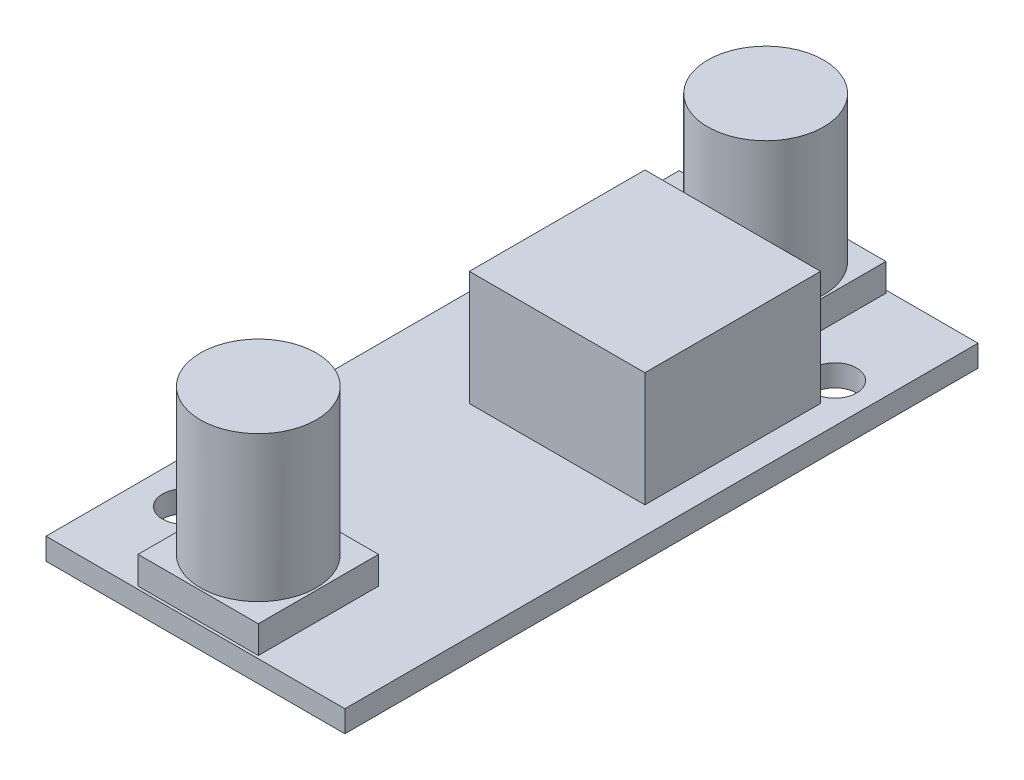
ISO-10303-21;
HEADER;
FILE_DESCRIPTION(('STEP AP214'),'2;1');
FILE_NAME('part.step','',(''),(''),'','','');
FILE_SCHEMA(('AUTOMOTIVE_DESIGN { 1 0 10303 214 1 1 1 1 }'));
ENDSEC;
DATA;
#1=APPLICATION_CONTEXT('core data for automotive mechanical design processes');
#2=APPLICATION_PROTOCOL_DEFINITION('international standard','automotive_design',2000,#1);
#3=PRODUCT_CONTEXT('',#1,'mechanical');
#4=PRODUCT('Part','Part','',(#3));
#5=PRODUCT_RELATED_PRODUCT_CATEGORY('part','',(#4));
#6=PRODUCT_DEFINITION_FORMATION('','',#4);
#7=PRODUCT_DEFINITION_CONTEXT('part definition',#1,'design');
#8=PRODUCT_DEFINITION('design','',#6,#7);
#9=PRODUCT_DEFINITION_SHAPE('','',#8);
#10=(LENGTH_UNIT() NAMED_UNIT(*) SI_UNIT(.MILLI.,.METRE.));
#11=(NAMED_UNIT(*) PLANE_ANGLE_UNIT() SI_UNIT($,.RADIAN.));
#12=(NAMED_UNIT(*) SI_UNIT($,.STERADIAN.) SOLID_ANGLE_UNIT());
#13=UNCERTAINTY_MEASURE_WITH_UNIT(LENGTH_MEASURE(1.E-05),#10,'distance_accuracy_value','');
#14=(GEOMETRIC_REPRESENTATION_CONTEXT(3) GLOBAL_UNCERTAINTY_ASSIGNED_CONTEXT((#13)) GLOBAL_UNIT_ASSIGNED_CONTEXT((#10,
#11,#12)) REPRESENTATION_CONTEXT('',''));
#15=CARTESIAN_POINT('',(0.,0.,0.));
#16=DIRECTION('',(0.,0.,1.));
#17=DIRECTION('',(1.,0.,0.));
#18=AXIS2_PLACEMENT_3D('',#15,#16,#17);
#19=CARTESIAN_POINT('',(0.,1.5,0.));
#20=DIRECTION('',(0.,1.,0.));
#21=DIRECTION('',(0.,0.,1.));
#22=AXIS2_PLACEMENT_3D('',#19,#20,#21);
#23=PLANE('',#22);
#24=DIRECTION('',(1.,0.,0.));
#25=VECTOR('',#24,1.);
#26=CARTESIAN_POINT('',(0.,1.5,-21.66));
#27=LINE('',#26,#25);
#28=CARTESIAN_POINT('',(-4.15,1.5,-21.66));
#29=VERTEX_POINT('',#28);
#30=CARTESIAN_POINT('',(4.15,1.5,-21.66));
#31=VERTEX_POINT('',#30);
#32=EDGE_CURVE('E180',#29,#31,#27,.T.);
#33=ORIENTED_EDGE('',*,*,#32,.T.);
#34=DIRECTION('',(0.,0.,1.));
#35=VECTOR('',#34,1.);
#36=CARTESIAN_POINT('',(4.15,1.5,-13.36));
#37=LINE('',#36,#35);
#38=CARTESIAN_POINT('',(4.15,1.5,-13.36));
#39=VERTEX_POINT('',#38);
#40=EDGE_CURVE('E186',#31,#39,#37,.T.);
#41=ORIENTED_EDGE('',*,*,#40,.T.);
#42=DIRECTION('',(-1.,0.,0.));
#43=VECTOR('',#42,1.);
#44=CARTESIAN_POINT('',(-4.15,1.5,-13.36));
#45=LINE('',#44,#43);
#46=CARTESIAN_POINT('',(-4.15,1.5,-13.36));
#47=VERTEX_POINT('',#46);
#48=EDGE_CURVE('E198',#39,#47,#45,.T.);
#49=ORIENTED_EDGE('',*,*,#48,.T.);
#50=DIRECTION('',(0.,0.,-1.));
#51=VECTOR('',#50,1.);
#52=CARTESIAN_POINT('',(-4.15,1.5,-21.66));
#53=LINE('',#52,#51);
#54=EDGE_CURVE('E56',#47,#29,#53,.T.);
#55=ORIENTED_EDGE('',*,*,#54,.T.);
#56=EDGE_LOOP('',(#33,#41,#49,#55));
#57=FACE_BOUND('',#56,.T.);
#58=CARTESIAN_POINT('',(-7.315,1.5,15.31));
#59=DIRECTION('',(0.,1.,0.));
#60=DIRECTION('',(0.,0.,1.));
#61=AXIS2_PLACEMENT_3D('',#58,#59,#60);
#62=CIRCLE('',#61,1.5);
#63=CARTESIAN_POINT('',(-7.315,1.5,16.81));
#64=VERTEX_POINT('',#63);
#65=EDGE_CURVE('E244',#64,#64,#62,.T.);
#66=ORIENTED_EDGE('',*,*,#65,.F.);
#67=EDGE_LOOP('',(#66));
#68=FACE_BOUND('',#67,.T.);
#69=CARTESIAN_POINT('',(7.605,1.5,-14.68));
#70=DIRECTION('',(0.,1.,0.));
#71=DIRECTION('',(0.,0.,1.));
#72=AXIS2_PLACEMENT_3D('',#69,#70,#71);
#73=CIRCLE('',#72,1.5);
#74=CARTESIAN_POINT('',(7.605,1.5,-13.18));
#75=VERTEX_POINT('',#74);
#76=EDGE_CURVE('E248',#75,#75,#73,.T.);
#77=ORIENTED_EDGE('',*,*,#76,.F.);
#78=EDGE_LOOP('',(#77));
#79=FACE_BOUND('',#78,.T.);
#80=DIRECTION('',(0.,0.,-1.));
#81=VECTOR('',#80,1.);
#82=CARTESIAN_POINT('',(10.315,1.5,-21.85));
#83=LINE('',#82,#81);
#84=CARTESIAN_POINT('',(10.315,1.5,21.85));
#85=VERTEX_POINT('',#84);
#86=CARTESIAN_POINT('',(10.315,1.5,-21.85));
#87=VERTEX_POINT('',#86);
#88=EDGE_CURVE('E257',#85,#87,#83,.T.);
#89=ORIENTED_EDGE('',*,*,#88,.T.);
#90=DIRECTION('',(-1.,0.,0.));
#91=VECTOR('',#90,1.);
#92=CARTESIAN_POINT('',(-10.315,1.5,-21.85));
#93=LINE('',#92,#91);
#94=CARTESIAN_POINT('',(-10.315,1.5,-21.85));
#95=VERTEX_POINT('',#94);
#96=EDGE_CURVE('E260',#87,#95,#93,.T.);
#97=ORIENTED_EDGE('',*,*,#96,.T.);
#98=DIRECTION('',(0.,0.,1.));
#99=VECTOR('',#98,1.);
#100=CARTESIAN_POINT('',(-10.315,1.5,-21.85));
#101=LINE('',#100,#99);
#102=CARTESIAN_POINT('',(-10.315,1.5,21.85));
#103=VERTEX_POINT('',#102);
#104=EDGE_CURVE('E263',#95,#103,#101,.T.);
#105=ORIENTED_EDGE('',*,*,#104,.T.);
#106=DIRECTION('',(1.,0.,0.));
#107=VECTOR('',#106,1.);
#108=CARTESIAN_POINT('',(-10.315,1.5,21.85));
#109=LINE('',#108,#107);
#110=EDGE_CURVE('E265',#103,#85,#109,.T.);
#111=ORIENTED_EDGE('',*,*,#110,.T.);
#112=EDGE_LOOP('',(#89,#97,#105,#111));
#113=FACE_BOUND('',#112,.T.);
#114=DIRECTION('',(-1.,0.,0.));
#115=VECTOR('',#114,1.);
#116=CARTESIAN_POINT('',(-4.15,1.5,13.36));
#117=LINE('',#116,#115);
#118=CARTESIAN_POINT('',(4.15,1.5,13.36));
#119=VERTEX_POINT('',#118);
#120=CARTESIAN_POINT('',(-4.15,1.5,13.36));
#121=VERTEX_POINT('',#120);
#122=EDGE_CURVE('E228',#119,#121,#117,.T.);
#123=ORIENTED_EDGE('',*,*,#122,.F.);
#124=DIRECTION('',(0.,0.,-1.));
#125=VECTOR('',#124,1.);
#126=CARTESIAN_POINT('',(4.15,1.5,13.36));
#127=LINE('',#126,#125);
#128=CARTESIAN_POINT('',(4.15,1.5,21.66));
#129=VERTEX_POINT('',#128);
#130=EDGE_CURVE('E214',#129,#119,#127,.T.);
#131=ORIENTED_EDGE('',*,*,#130,.F.);
#132=DIRECTION('',(1.,0.,0.));
#133=VECTOR('',#132,1.);
#134=CARTESIAN_POINT('',(0.,1.5,21.66));
#135=LINE('',#134,#133);
#136=CARTESIAN_POINT('',(-4.15,1.5,21.66));
#137=VERTEX_POINT('',#136);
#138=EDGE_CURVE('E219',#137,#129,#135,.T.);
#139=ORIENTED_EDGE('',*,*,#138,.F.);
#140=DIRECTION('',(0.,0.,1.));
#141=VECTOR('',#140,1.);
#142=CARTESIAN_POINT('',(-4.15,1.5,21.66));
#143=LINE('',#142,#141);
#144=EDGE_CURVE('E230',#121,#137,#143,.T.);
#145=ORIENTED_EDGE('',*,*,#144,.F.);
#146=EDGE_LOOP('',(#123,#131,#139,#145));
#147=FACE_BOUND('',#146,.T.);
#148=DIRECTION('',(-1.,0.,0.));
#149=VECTOR('',#148,1.);
#150=CARTESIAN_POINT('',(-3.635,1.5,-12.81));
#151=LINE('',#150,#149);
#152=CARTESIAN_POINT('',(8.485,1.5,-12.81));
#153=VERTEX_POINT('',#152);
#154=CARTESIAN_POINT('',(-3.635,1.5,-12.81));
#155=VERTEX_POINT('',#154);
#156=EDGE_CURVE('E311',#153,#155,#151,.T.);
#157=ORIENTED_EDGE('',*,*,#156,.F.);
#158=DIRECTION('',(0.,0.,-1.));
#159=VECTOR('',#158,1.);
#160=CARTESIAN_POINT('',(8.485,1.5,-12.81));
#161=LINE('',#160,#159);
#162=CARTESIAN_POINT('',(8.485,1.5,-0.689999999999993));
#163=VERTEX_POINT('',#162);
#164=EDGE_CURVE('E169',#163,#153,#161,.T.);
#165=ORIENTED_EDGE('',*,*,#164,.F.);
#166=DIRECTION('',(1.,0.,0.));
#167=VECTOR('',#166,1.);
#168=CARTESIAN_POINT('',(-3.63499999999999,1.5,-0.689999999999993));
#169=LINE('',#168,#167);
#170=CARTESIAN_POINT('',(-3.63499999999999,1.5,-0.689999999999993));
#171=VERTEX_POINT('',#170);
#172=EDGE_CURVE('E165',#171,#163,#169,.T.);
#173=ORIENTED_EDGE('',*,*,#172,.F.);
#174=DIRECTION('',(0.,0.,1.));
#175=VECTOR('',#174,1.);
#176=CARTESIAN_POINT('',(-3.635,1.5,-12.81));
#177=LINE('',#176,#175);
#178=EDGE_CURVE('E313',#155,#171,#177,.T.);
#179=ORIENTED_EDGE('',*,*,#178,.F.);
#180=EDGE_LOOP('',(#157,#165,#173,#179));
#181=FACE_BOUND('',#180,.T.);
#182=ADVANCED_FACE('F33',(#57,#68,#79,#113,#147,#181),#23,.T.);
#183=CARTESIAN_POINT('',(10.315,1.5,-21.85));
#184=DIRECTION('',(-1.,0.,0.));
#185=DIRECTION('',(0.,0.,1.));
#186=AXIS2_PLACEMENT_3D('',#183,#184,#185);
#187=PLANE('',#186);
#188=DIRECTION('',(0.,0.,-1.));
#189=VECTOR('',#188,1.);
#190=CARTESIAN_POINT('',(10.315,0.,-21.85));
#191=LINE('',#190,#189);
#192=CARTESIAN_POINT('',(10.315,0.,21.85));
#193=VERTEX_POINT('',#192);
#194=CARTESIAN_POINT('',(10.315,0.,-21.85));
#195=VERTEX_POINT('',#194);
#196=EDGE_CURVE('E254',#193,#195,#191,.T.);
#197=ORIENTED_EDGE('',*,*,#196,.T.);
#198=DIRECTION('',(0.,-1.,0.));
#199=VECTOR('',#198,1.);
#200=CARTESIAN_POINT('',(10.315,1.5,-21.85));
#201=LINE('',#200,#199);
#202=EDGE_CURVE('E41',#87,#195,#201,.T.);
#203=ORIENTED_EDGE('',*,*,#202,.F.);
#204=ORIENTED_EDGE('',*,*,#88,.F.);
#205=DIRECTION('',(0.,-1.,0.));
#206=VECTOR('',#205,1.);
#207=CARTESIAN_POINT('',(10.315,1.5,21.85));
#208=LINE('',#207,#206);
#209=EDGE_CURVE('E267',#85,#193,#208,.T.);
#210=ORIENTED_EDGE('',*,*,#209,.T.);
#211=EDGE_LOOP('',(#197,#203,#204,#210));
#212=FACE_BOUND('',#211,.T.);
#213=ADVANCED_FACE('F35',(#212),#187,.F.);
#214=CARTESIAN_POINT('',(-10.315,1.5,-21.85));
#215=DIRECTION('',(0.,0.,1.));
#216=DIRECTION('',(1.,0.,0.));
#217=AXIS2_PLACEMENT_3D('',#214,#215,#216);
#218=PLANE('',#217);
#219=DIRECTION('',(-1.,0.,0.));
#220=VECTOR('',#219,1.);
#221=CARTESIAN_POINT('',(-10.315,0.,-21.85));
#222=LINE('',#221,#220);
#223=CARTESIAN_POINT('',(-10.315,0.,-21.85));
#224=VERTEX_POINT('',#223);
#225=EDGE_CURVE('E270',#195,#224,#222,.T.);
#226=ORIENTED_EDGE('',*,*,#225,.T.);
#227=DIRECTION('',(0.,-1.,0.));
#228=VECTOR('',#227,1.);
#229=CARTESIAN_POINT('',(-10.315,1.5,-21.85));
#230=LINE('',#229,#228);
#231=EDGE_CURVE('E280',#95,#224,#230,.T.);
#232=ORIENTED_EDGE('',*,*,#231,.F.);
#233=ORIENTED_EDGE('',*,*,#96,.F.);
#234=ORIENTED_EDGE('',*,*,#202,.T.);
#235=EDGE_LOOP('',(#226,#232,#233,#234));
#236=FACE_BOUND('',#235,.T.);
#237=ADVANCED_FACE('F285',(#236),#218,.F.);
#238=CARTESIAN_POINT('',(-10.315,1.5,-21.85));
#239=DIRECTION('',(1.,0.,0.));
#240=DIRECTION('',(0.,0.,-1.));
#241=AXIS2_PLACEMENT_3D('',#238,#239,#240);
#242=PLANE('',#241);
#243=DIRECTION('',(0.,0.,1.));
#244=VECTOR('',#243,1.);
#245=CARTESIAN_POINT('',(-10.315,0.,-21.85));
#246=LINE('',#245,#244);
#247=CARTESIAN_POINT('',(-10.315,0.,21.85));
#248=VERTEX_POINT('',#247);
#249=EDGE_CURVE('E272',#224,#248,#246,.T.);
#250=ORIENTED_EDGE('',*,*,#249,.T.);
#251=DIRECTION('',(0.,-1.,0.));
#252=VECTOR('',#251,1.);
#253=CARTESIAN_POINT('',(-10.315,1.5,21.85));
#254=LINE('',#253,#252);
#255=EDGE_CURVE('E277',#103,#248,#254,.T.);
#256=ORIENTED_EDGE('',*,*,#255,.F.);
#257=ORIENTED_EDGE('',*,*,#104,.F.);
#258=ORIENTED_EDGE('',*,*,#231,.T.);
#259=EDGE_LOOP('',(#250,#256,#257,#258));
#260=FACE_BOUND('',#259,.T.);
#261=ADVANCED_FACE('F297',(#260),#242,.F.);
#262=CARTESIAN_POINT('',(-10.315,1.5,21.85));
#263=DIRECTION('',(0.,0.,-1.));
#264=DIRECTION('',(-1.,0.,0.));
#265=AXIS2_PLACEMENT_3D('',#262,#263,#264);
#266=PLANE('',#265);
#267=DIRECTION('',(1.,0.,0.));
#268=VECTOR('',#267,1.);
#269=CARTESIAN_POINT('',(-10.315,0.,21.85));
#270=LINE('',#269,#268);
#271=EDGE_CURVE('E261',#248,#193,#270,.T.);
#272=ORIENTED_EDGE('',*,*,#271,.T.);
#273=ORIENTED_EDGE('',*,*,#209,.F.);
#274=ORIENTED_EDGE('',*,*,#110,.F.);
#275=ORIENTED_EDGE('',*,*,#255,.T.);
#276=EDGE_LOOP('',(#272,#273,#274,#275));
#277=FACE_BOUND('',#276,.T.);
#278=ADVANCED_FACE('F301',(#277),#266,.F.);
#279=CARTESIAN_POINT('',(0.,0.,0.));
#280=DIRECTION('',(0.,1.,0.));
#281=DIRECTION('',(0.,0.,1.));
#282=AXIS2_PLACEMENT_3D('',#279,#280,#281);
#283=PLANE('',#282);
#284=CARTESIAN_POINT('',(-7.315,0.,15.31));
#285=DIRECTION('',(0.,1.,0.));
#286=DIRECTION('',(0.,0.,1.));
#287=AXIS2_PLACEMENT_3D('',#284,#285,#286);
#288=CIRCLE('',#287,1.5);
#289=CARTESIAN_POINT('',(-7.315,0.,16.81));
#290=VERTEX_POINT('',#289);
#291=EDGE_CURVE('E245',#290,#290,#288,.T.);
#292=ORIENTED_EDGE('',*,*,#291,.T.);
#293=EDGE_LOOP('',(#292));
#294=FACE_BOUND('',#293,.T.);
#295=CARTESIAN_POINT('',(7.605,0.,-14.68));
#296=DIRECTION('',(0.,1.,0.));
#297=DIRECTION('',(0.,0.,1.));
#298=AXIS2_PLACEMENT_3D('',#295,#296,#297);
#299=CIRCLE('',#298,1.5);
#300=CARTESIAN_POINT('',(7.605,0.,-13.18));
#301=VERTEX_POINT('',#300);
#302=EDGE_CURVE('E251',#301,#301,#299,.T.);
#303=ORIENTED_EDGE('',*,*,#302,.T.);
#304=EDGE_LOOP('',(#303));
#305=FACE_BOUND('',#304,.T.);
#306=ORIENTED_EDGE('',*,*,#196,.F.);
#307=ORIENTED_EDGE('',*,*,#271,.F.);
#308=ORIENTED_EDGE('',*,*,#249,.F.);
#309=ORIENTED_EDGE('',*,*,#225,.F.);
#310=EDGE_LOOP('',(#306,#307,#308,#309));
#311=FACE_BOUND('',#310,.T.);
#312=ADVANCED_FACE('F293',(#294,#305,#311),#283,.F.);
#313=CARTESIAN_POINT('',(7.605,0.,-14.68));
#314=DIRECTION('',(0.,1.,0.));
#315=DIRECTION('',(0.,0.,1.));
#316=AXIS2_PLACEMENT_3D('',#313,#314,#315);
#317=CYLINDRICAL_SURFACE('',#316,1.5);
#318=ORIENTED_EDGE('',*,*,#302,.F.);
#319=EDGE_LOOP('',(#318));
#320=FACE_BOUND('',#319,.T.);
#321=ORIENTED_EDGE('',*,*,#76,.T.);
#322=EDGE_LOOP('',(#321));
#323=FACE_BOUND('',#322,.T.);
#324=ADVANCED_FACE('F397',(#320,#323),#317,.F.);
#325=CARTESIAN_POINT('',(-7.315,0.,15.31));
#326=DIRECTION('',(0.,1.,0.));
#327=DIRECTION('',(0.,0.,1.));
#328=AXIS2_PLACEMENT_3D('',#325,#326,#327);
#329=CYLINDRICAL_SURFACE('',#328,1.5);
#330=ORIENTED_EDGE('',*,*,#291,.F.);
#331=EDGE_LOOP('',(#330));
#332=FACE_BOUND('',#331,.T.);
#333=ORIENTED_EDGE('',*,*,#65,.T.);
#334=EDGE_LOOP('',(#333));
#335=FACE_BOUND('',#334,.T.);
#336=ADVANCED_FACE('F393',(#332,#335),#329,.F.);
#337=CARTESIAN_POINT('',(4.15,3.4,13.36));
#338=DIRECTION('',(-1.,0.,0.));
#339=DIRECTION('',(0.,0.,1.));
#340=AXIS2_PLACEMENT_3D('',#337,#338,#339);
#341=PLANE('',#340);
#342=ORIENTED_EDGE('',*,*,#130,.T.);
#343=DIRECTION('',(0.,-1.,0.));
#344=VECTOR('',#343,1.);
#345=CARTESIAN_POINT('',(4.15,3.4,13.36));
#346=LINE('',#345,#344);
#347=CARTESIAN_POINT('',(4.15,3.4,13.36));
#348=VERTEX_POINT('',#347);
#349=EDGE_CURVE('E238',#348,#119,#346,.T.);
#350=ORIENTED_EDGE('',*,*,#349,.F.);
#351=DIRECTION('',(0.,0.,-1.));
#352=VECTOR('',#351,1.);
#353=CARTESIAN_POINT('',(4.15,3.4,13.36));
#354=LINE('',#353,#352);
#355=CARTESIAN_POINT('',(4.15,3.4,21.66));
#356=VERTEX_POINT('',#355);
#357=EDGE_CURVE('E218',#356,#348,#354,.T.);
#358=ORIENTED_EDGE('',*,*,#357,.F.);
#359=DIRECTION('',(0.,-1.,0.));
#360=VECTOR('',#359,1.);
#361=CARTESIAN_POINT('',(4.15,3.4,21.66));
#362=LINE('',#361,#360);
#363=EDGE_CURVE('E241',#356,#129,#362,.T.);
#364=ORIENTED_EDGE('',*,*,#363,.T.);
#365=EDGE_LOOP('',(#342,#350,#358,#364));
#366=FACE_BOUND('',#365,.T.);
#367=ADVANCED_FACE('F389',(#366),#341,.F.);
#368=CARTESIAN_POINT('',(-4.15,3.4,13.36));
#369=DIRECTION('',(0.,0.,1.));
#370=DIRECTION('',(1.,0.,0.));
#371=AXIS2_PLACEMENT_3D('',#368,#369,#370);
#372=PLANE('',#371);
#373=ORIENTED_EDGE('',*,*,#122,.T.);
#374=DIRECTION('',(0.,-1.,0.));
#375=VECTOR('',#374,1.);
#376=CARTESIAN_POINT('',(-4.15,3.4,13.36));
#377=LINE('',#376,#375);
#378=CARTESIAN_POINT('',(-4.15,3.4,13.36));
#379=VERTEX_POINT('',#378);
#380=EDGE_CURVE('E235',#379,#121,#377,.T.);
#381=ORIENTED_EDGE('',*,*,#380,.F.);
#382=DIRECTION('',(-1.,0.,0.));
#383=VECTOR('',#382,1.);
#384=CARTESIAN_POINT('',(-4.15,3.4,13.36));
#385=LINE('',#384,#383);
#386=EDGE_CURVE('E221',#348,#379,#385,.T.);
#387=ORIENTED_EDGE('',*,*,#386,.F.);
#388=ORIENTED_EDGE('',*,*,#349,.T.);
#389=EDGE_LOOP('',(#373,#381,#387,#388));
#390=FACE_BOUND('',#389,.T.);
#391=ADVANCED_FACE('F385',(#390),#372,.F.);
#392=CARTESIAN_POINT('',(-4.15,3.4,21.66));
#393=DIRECTION('',(1.,0.,0.));
#394=DIRECTION('',(0.,0.,-1.));
#395=AXIS2_PLACEMENT_3D('',#392,#393,#394);
#396=PLANE('',#395);
#397=ORIENTED_EDGE('',*,*,#144,.T.);
#398=DIRECTION('',(0.,-1.,0.));
#399=VECTOR('',#398,1.);
#400=CARTESIAN_POINT('',(-4.15,3.4,21.66));
#401=LINE('',#400,#399);
#402=CARTESIAN_POINT('',(-4.15,3.4,21.66));
#403=VERTEX_POINT('',#402);
#404=EDGE_CURVE('E226',#403,#137,#401,.T.);
#405=ORIENTED_EDGE('',*,*,#404,.F.);
#406=DIRECTION('',(0.,0.,1.));
#407=VECTOR('',#406,1.);
#408=CARTESIAN_POINT('',(-4.15,3.4,21.66));
#409=LINE('',#408,#407);
#410=EDGE_CURVE('E223',#379,#403,#409,.T.);
#411=ORIENTED_EDGE('',*,*,#410,.F.);
#412=ORIENTED_EDGE('',*,*,#380,.T.);
#413=EDGE_LOOP('',(#397,#405,#411,#412));
#414=FACE_BOUND('',#413,.T.);
#415=ADVANCED_FACE('F381',(#414),#396,.F.);
#416=CARTESIAN_POINT('',(0.,3.4,21.66));
#417=DIRECTION('',(0.,0.,-1.));
#418=DIRECTION('',(-1.,0.,0.));
#419=AXIS2_PLACEMENT_3D('',#416,#417,#418);
#420=PLANE('',#419);
#421=ORIENTED_EDGE('',*,*,#138,.T.);
#422=ORIENTED_EDGE('',*,*,#363,.F.);
#423=DIRECTION('',(1.,0.,0.));
#424=VECTOR('',#423,1.);
#425=CARTESIAN_POINT('',(4.15,3.4,21.66));
#426=LINE('',#425,#424);
#427=EDGE_CURVE('E215',#403,#356,#426,.T.);
#428=ORIENTED_EDGE('',*,*,#427,.F.);
#429=ORIENTED_EDGE('',*,*,#404,.T.);
#430=EDGE_LOOP('',(#421,#422,#428,#429));
#431=FACE_BOUND('',#430,.T.);
#432=ADVANCED_FACE('F377',(#431),#420,.F.);
#433=CARTESIAN_POINT('',(0.,3.4,0.));
#434=DIRECTION('',(0.,-1.,0.));
#435=DIRECTION('',(0.,0.,-1.));
#436=AXIS2_PLACEMENT_3D('',#433,#434,#435);
#437=PLANE('',#436);
#438=CARTESIAN_POINT('',(0.,3.4,17.51));
#439=DIRECTION('',(0.,-1.,0.));
#440=DIRECTION('',(0.,0.,-1.));
#441=AXIS2_PLACEMENT_3D('',#438,#439,#440);
#442=CIRCLE('',#441,4.);
#443=CARTESIAN_POINT('',(0.,3.4,13.51));
#444=VERTEX_POINT('',#443);
#445=EDGE_CURVE('E11',#444,#444,#442,.F.);
#446=ORIENTED_EDGE('',*,*,#445,.F.);
#447=EDGE_LOOP('',(#446));
#448=FACE_BOUND('',#447,.T.);
#449=ORIENTED_EDGE('',*,*,#427,.T.);
#450=ORIENTED_EDGE('',*,*,#357,.T.);
#451=ORIENTED_EDGE('',*,*,#386,.T.);
#452=ORIENTED_EDGE('',*,*,#410,.T.);
#453=EDGE_LOOP('',(#449,#450,#451,#452));
#454=FACE_BOUND('',#453,.T.);
#455=ADVANCED_FACE('F373',(#448,#454),#437,.F.);
#456=CARTESIAN_POINT('',(0.,13.44,17.51));
#457=DIRECTION('',(0.,-1.,0.));
#458=DIRECTION('',(0.,0.,-1.));
#459=AXIS2_PLACEMENT_3D('',#456,#457,#458);
#460=CYLINDRICAL_SURFACE('',#459,4.);
#461=CARTESIAN_POINT('',(0.,13.44,17.51));
#462=DIRECTION('',(0.,1.,0.));
#463=DIRECTION('',(0.,0.,1.));
#464=AXIS2_PLACEMENT_3D('',#461,#462,#463);
#465=CIRCLE('',#464,4.);
#466=CARTESIAN_POINT('',(0.,13.44,21.51));
#467=VERTEX_POINT('',#466);
#468=EDGE_CURVE('E211',#467,#467,#465,.T.);
#469=ORIENTED_EDGE('',*,*,#468,.F.);
#470=EDGE_LOOP('',(#469));
#471=FACE_BOUND('',#470,.T.);
#472=ORIENTED_EDGE('',*,*,#445,.T.);
#473=EDGE_LOOP('',(#472));
#474=FACE_BOUND('',#473,.T.);
#475=ADVANCED_FACE('F369',(#471,#474),#460,.T.);
#476=CARTESIAN_POINT('',(0.,13.44,17.51));
#477=DIRECTION('',(0.,1.,0.));
#478=DIRECTION('',(0.,0.,1.));
#479=AXIS2_PLACEMENT_3D('',#476,#477,#478);
#480=PLANE('',#479);
#481=ORIENTED_EDGE('',*,*,#468,.T.);
#482=EDGE_LOOP('',(#481));
#483=FACE_BOUND('',#482,.T.);
#484=ADVANCED_FACE('F365',(#483),#480,.T.);
#485=CARTESIAN_POINT('',(0.,3.4,-21.66));
#486=DIRECTION('',(0.,0.,-1.));
#487=DIRECTION('',(-1.,0.,0.));
#488=AXIS2_PLACEMENT_3D('',#485,#486,#487);
#489=PLANE('',#488);
#490=ORIENTED_EDGE('',*,*,#32,.F.);
#491=DIRECTION('',(0.,-1.,0.));
#492=VECTOR('',#491,1.);
#493=CARTESIAN_POINT('',(-4.15,3.4,-21.66));
#494=LINE('',#493,#492);
#495=CARTESIAN_POINT('',(-4.15,3.4,-21.66));
#496=VERTEX_POINT('',#495);
#497=EDGE_CURVE('E209',#496,#29,#494,.T.);
#498=ORIENTED_EDGE('',*,*,#497,.F.);
#499=DIRECTION('',(1.,0.,0.));
#500=VECTOR('',#499,1.);
#501=CARTESIAN_POINT('',(4.15,3.4,-21.66));
#502=LINE('',#501,#500);
#503=CARTESIAN_POINT('',(4.15,3.4,-21.66));
#504=VERTEX_POINT('',#503);
#505=EDGE_CURVE('E182',#496,#504,#502,.T.);
#506=ORIENTED_EDGE('',*,*,#505,.T.);
#507=DIRECTION('',(0.,-1.,0.));
#508=VECTOR('',#507,1.);
#509=CARTESIAN_POINT('',(4.15,3.4,-21.66));
#510=LINE('',#509,#508);
#511=EDGE_CURVE('E195',#504,#31,#510,.T.);
#512=ORIENTED_EDGE('',*,*,#511,.T.);
#513=EDGE_LOOP('',(#490,#498,#506,#512));
#514=FACE_BOUND('',#513,.T.);
#515=ADVANCED_FACE('F361',(#514),#489,.T.);
#516=CARTESIAN_POINT('',(-4.15,3.4,-21.66));
#517=DIRECTION('',(-1.,0.,0.));
#518=DIRECTION('',(0.,0.,1.));
#519=AXIS2_PLACEMENT_3D('',#516,#517,#518);
#520=PLANE('',#519);
#521=ORIENTED_EDGE('',*,*,#54,.F.);
#522=DIRECTION('',(0.,-1.,0.));
#523=VECTOR('',#522,1.);
#524=CARTESIAN_POINT('',(-4.15,3.4,-13.36));
#525=LINE('',#524,#523);
#526=CARTESIAN_POINT('',(-4.15,3.4,-13.36));
#527=VERTEX_POINT('',#526);
#528=EDGE_CURVE('E206',#527,#47,#525,.T.);
#529=ORIENTED_EDGE('',*,*,#528,.F.);
#530=DIRECTION('',(0.,0.,-1.));
#531=VECTOR('',#530,1.);
#532=CARTESIAN_POINT('',(-4.15,3.4,-21.66));
#533=LINE('',#532,#531);
#534=EDGE_CURVE('E185',#527,#496,#533,.T.);
#535=ORIENTED_EDGE('',*,*,#534,.T.);
#536=ORIENTED_EDGE('',*,*,#497,.T.);
#537=EDGE_LOOP('',(#521,#529,#535,#536));
#538=FACE_BOUND('',#537,.T.);
#539=ADVANCED_FACE('F357',(#538),#520,.T.);
#540=CARTESIAN_POINT('',(-4.15,3.4,-13.36));
#541=DIRECTION('',(0.,0.,1.));
#542=DIRECTION('',(1.,0.,0.));
#543=AXIS2_PLACEMENT_3D('',#540,#541,#542);
#544=PLANE('',#543);
#545=ORIENTED_EDGE('',*,*,#48,.F.);
#546=DIRECTION('',(0.,-1.,0.));
#547=VECTOR('',#546,1.);
#548=CARTESIAN_POINT('',(4.15,3.4,-13.36));
#549=LINE('',#548,#547);
#550=CARTESIAN_POINT('',(4.15,3.4,-13.36));
#551=VERTEX_POINT('',#550);
#552=EDGE_CURVE('E203',#551,#39,#549,.T.);
#553=ORIENTED_EDGE('',*,*,#552,.F.);
#554=DIRECTION('',(-1.,0.,0.));
#555=VECTOR('',#554,1.);
#556=CARTESIAN_POINT('',(-4.15,3.4,-13.36));
#557=LINE('',#556,#555);
#558=EDGE_CURVE('E189',#551,#527,#557,.T.);
#559=ORIENTED_EDGE('',*,*,#558,.T.);
#560=ORIENTED_EDGE('',*,*,#528,.T.);
#561=EDGE_LOOP('',(#545,#553,#559,#560));
#562=FACE_BOUND('',#561,.T.);
#563=ADVANCED_FACE('F353',(#562),#544,.T.);
#564=CARTESIAN_POINT('',(4.15,3.4,-13.36));
#565=DIRECTION('',(1.,0.,0.));
#566=DIRECTION('',(0.,0.,-1.));
#567=AXIS2_PLACEMENT_3D('',#564,#565,#566);
#568=PLANE('',#567);
#569=ORIENTED_EDGE('',*,*,#40,.F.);
#570=ORIENTED_EDGE('',*,*,#511,.F.);
#571=DIRECTION('',(0.,0.,1.));
#572=VECTOR('',#571,1.);
#573=CARTESIAN_POINT('',(4.15,3.4,-13.36));
#574=LINE('',#573,#572);
#575=EDGE_CURVE('E192',#504,#551,#574,.T.);
#576=ORIENTED_EDGE('',*,*,#575,.T.);
#577=ORIENTED_EDGE('',*,*,#552,.T.);
#578=EDGE_LOOP('',(#569,#570,#576,#577));
#579=FACE_BOUND('',#578,.T.);
#580=ADVANCED_FACE('F349',(#579),#568,.T.);
#581=CARTESIAN_POINT('',(0.,3.4,0.));
#582=DIRECTION('',(0.,-1.,0.));
#583=DIRECTION('',(0.,0.,1.));
#584=AXIS2_PLACEMENT_3D('',#581,#582,#583);
#585=PLANE('',#584);
#586=CARTESIAN_POINT('',(0.,3.4,-17.51));
#587=DIRECTION('',(0.,-1.,0.));
#588=DIRECTION('',(0.,0.,-1.));
#589=AXIS2_PLACEMENT_3D('',#586,#587,#588);
#590=CIRCLE('',#589,4.);
#591=CARTESIAN_POINT('',(0.,3.4,-21.51));
#592=VERTEX_POINT('',#591);
#593=EDGE_CURVE('E171',#592,#592,#590,.T.);
#594=ORIENTED_EDGE('',*,*,#593,.T.);
#595=EDGE_LOOP('',(#594));
#596=FACE_BOUND('',#595,.T.);
#597=ORIENTED_EDGE('',*,*,#505,.F.);
#598=ORIENTED_EDGE('',*,*,#534,.F.);
#599=ORIENTED_EDGE('',*,*,#558,.F.);
#600=ORIENTED_EDGE('',*,*,#575,.F.);
#601=EDGE_LOOP('',(#597,#598,#599,#600));
#602=FACE_BOUND('',#601,.T.);
#603=ADVANCED_FACE('F345',(#596,#602),#585,.F.);
#604=CARTESIAN_POINT('',(0.,13.44,-17.51));
#605=DIRECTION('',(0.,-1.,0.));
#606=DIRECTION('',(0.,0.,-1.));
#607=AXIS2_PLACEMENT_3D('',#604,#605,#606);
#608=CYLINDRICAL_SURFACE('',#607,4.);
#609=CARTESIAN_POINT('',(0.,13.44,-17.51));
#610=DIRECTION('',(0.,-1.,0.));
#611=DIRECTION('',(0.,0.,-1.));
#612=AXIS2_PLACEMENT_3D('',#609,#610,#611);
#613=CIRCLE('',#612,4.);
#614=CARTESIAN_POINT('',(0.,13.44,-21.51));
#615=VERTEX_POINT('',#614);
#616=EDGE_CURVE('E174',#615,#615,#613,.T.);
#617=ORIENTED_EDGE('',*,*,#616,.T.);
#618=EDGE_LOOP('',(#617));
#619=FACE_BOUND('',#618,.T.);
#620=ORIENTED_EDGE('',*,*,#593,.F.);
#621=EDGE_LOOP('',(#620));
#622=FACE_BOUND('',#621,.T.);
#623=ADVANCED_FACE('F341',(#619,#622),#608,.T.);
#624=CARTESIAN_POINT('',(0.,13.44,-17.51));
#625=DIRECTION('',(0.,1.,0.));
#626=DIRECTION('',(0.,0.,-1.));
#627=AXIS2_PLACEMENT_3D('',#624,#625,#626);
#628=PLANE('',#627);
#629=ORIENTED_EDGE('',*,*,#616,.F.);
#630=EDGE_LOOP('',(#629));
#631=FACE_BOUND('',#630,.T.);
#632=ADVANCED_FACE('F338',(#631),#628,.T.);
#633=CARTESIAN_POINT('',(8.485,9.4,-12.81));
#634=DIRECTION('',(-1.,0.,0.));
#635=DIRECTION('',(0.,0.,1.));
#636=AXIS2_PLACEMENT_3D('',#633,#634,#635);
#637=PLANE('',#636);
#638=ORIENTED_EDGE('',*,*,#164,.T.);
#639=DIRECTION('',(0.,-1.,0.));
#640=VECTOR('',#639,1.);
#641=CARTESIAN_POINT('',(8.485,9.4,-12.81));
#642=LINE('',#641,#640);
#643=CARTESIAN_POINT('',(8.485,9.4,-12.81));
#644=VERTEX_POINT('',#643);
#645=EDGE_CURVE('E150',#644,#153,#642,.T.);
#646=ORIENTED_EDGE('',*,*,#645,.F.);
#647=DIRECTION('',(0.,0.,-1.));
#648=VECTOR('',#647,1.);
#649=CARTESIAN_POINT('',(8.485,9.4,-12.81));
#650=LINE('',#649,#648);
#651=CARTESIAN_POINT('',(8.485,9.4,-0.689999999999993));
#652=VERTEX_POINT('',#651);
#653=EDGE_CURVE('E157',#652,#644,#650,.T.);
#654=ORIENTED_EDGE('',*,*,#653,.F.);
#655=DIRECTION('',(0.,-1.,0.));
#656=VECTOR('',#655,1.);
#657=CARTESIAN_POINT('',(8.485,9.4,-0.689999999999993));
#658=LINE('',#657,#656);
#659=EDGE_CURVE('E320',#652,#163,#658,.T.);
#660=ORIENTED_EDGE('',*,*,#659,.T.);
#661=EDGE_LOOP('',(#638,#646,#654,#660));
#662=FACE_BOUND('',#661,.T.);
#663=ADVANCED_FACE('F167',(#662),#637,.F.);
#664=CARTESIAN_POINT('',(-3.635,9.4,-12.81));
#665=DIRECTION('',(0.,0.,1.));
#666=DIRECTION('',(1.,0.,0.));
#667=AXIS2_PLACEMENT_3D('',#664,#665,#666);
#668=PLANE('',#667);
#669=ORIENTED_EDGE('',*,*,#156,.T.);
#670=DIRECTION('',(0.,-1.,0.));
#671=VECTOR('',#670,1.);
#672=CARTESIAN_POINT('',(-3.635,9.4,-12.81));
#673=LINE('',#672,#671);
#674=CARTESIAN_POINT('',(-3.635,9.4,-12.81));
#675=VERTEX_POINT('',#674);
#676=EDGE_CURVE('E153',#675,#155,#673,.T.);
#677=ORIENTED_EDGE('',*,*,#676,.F.);
#678=DIRECTION('',(-1.,0.,0.));
#679=VECTOR('',#678,1.);
#680=CARTESIAN_POINT('',(-3.635,9.4,-12.81));
#681=LINE('',#680,#679);
#682=EDGE_CURVE('E146',#644,#675,#681,.T.);
#683=ORIENTED_EDGE('',*,*,#682,.F.);
#684=ORIENTED_EDGE('',*,*,#645,.T.);
#685=EDGE_LOOP('',(#669,#677,#683,#684));
#686=FACE_BOUND('',#685,.T.);
#687=ADVANCED_FACE('F148',(#686),#668,.F.);
#688=CARTESIAN_POINT('',(-3.635,9.4,-12.81));
#689=DIRECTION('',(1.,0.,0.));
#690=DIRECTION('',(0.,0.,-1.));
#691=AXIS2_PLACEMENT_3D('',#688,#689,#690);
#692=PLANE('',#691);
#693=ORIENTED_EDGE('',*,*,#178,.T.);
#694=DIRECTION('',(0.,-1.,0.));
#695=VECTOR('',#694,1.);
#696=CARTESIAN_POINT('',(-3.63499999999999,9.4,-0.689999999999993));
#697=LINE('',#696,#695);
#698=CARTESIAN_POINT('',(-3.63499999999999,9.4,-0.689999999999993));
#699=VERTEX_POINT('',#698);
#700=EDGE_CURVE('E48',#699,#171,#697,.T.);
#701=ORIENTED_EDGE('',*,*,#700,.F.);
#702=DIRECTION('',(0.,0.,1.));
#703=VECTOR('',#702,1.);
#704=CARTESIAN_POINT('',(-3.635,9.4,-12.81));
#705=LINE('',#704,#703);
#706=EDGE_CURVE('E156',#675,#699,#705,.T.);
#707=ORIENTED_EDGE('',*,*,#706,.F.);
#708=ORIENTED_EDGE('',*,*,#676,.T.);
#709=EDGE_LOOP('',(#693,#701,#707,#708));
#710=FACE_BOUND('',#709,.T.);
#711=ADVANCED_FACE('F323',(#710),#692,.F.);
#712=CARTESIAN_POINT('',(-3.63499999999999,9.4,-0.689999999999993));
#713=DIRECTION('',(0.,0.,-1.));
#714=DIRECTION('',(-1.,0.,0.));
#715=AXIS2_PLACEMENT_3D('',#712,#713,#714);
#716=PLANE('',#715);
#717=ORIENTED_EDGE('',*,*,#172,.T.);
#718=ORIENTED_EDGE('',*,*,#659,.F.);
#719=DIRECTION('',(1.,0.,0.));
#720=VECTOR('',#719,1.);
#721=CARTESIAN_POINT('',(-3.63499999999999,9.4,-0.689999999999993));
#722=LINE('',#721,#720);
#723=EDGE_CURVE('E161',#699,#652,#722,.T.);
#724=ORIENTED_EDGE('',*,*,#723,.F.);
#725=ORIENTED_EDGE('',*,*,#700,.T.);
#726=EDGE_LOOP('',(#717,#718,#724,#725));
#727=FACE_BOUND('',#726,.T.);
#728=ADVANCED_FACE('F324',(#727),#716,.F.);
#729=CARTESIAN_POINT('',(0.,9.4,0.));
#730=DIRECTION('',(0.,1.,0.));
#731=DIRECTION('',(0.,0.,1.));
#732=AXIS2_PLACEMENT_3D('',#729,#730,#731);
#733=PLANE('',#732);
#734=ORIENTED_EDGE('',*,*,#653,.T.);
#735=ORIENTED_EDGE('',*,*,#682,.T.);
#736=ORIENTED_EDGE('',*,*,#706,.T.);
#737=ORIENTED_EDGE('',*,*,#723,.T.);
#738=EDGE_LOOP('',(#734,#735,#736,#737));
#739=FACE_BOUND('',#738,.T.);
#740=ADVANCED_FACE('F160',(#739),#733,.T.);
#741=CLOSED_SHELL('',(#182,#213,#237,#261,#278,#312,#324,#336,#367,#391,#415,#432,#455,#475,
#484,#515,#539,#563,#580,#603,#623,#632,#663,#687,#711,#728,#740));
#742=MANIFOLD_SOLID_BREP('B2',#741);
#743=ADVANCED_BREP_SHAPE_REPRESENTATION('',(#18,#742),#14);
#744=SHAPE_DEFINITION_REPRESENTATION(#9,#743);
ENDSEC;
END-ISO-10303-21;
